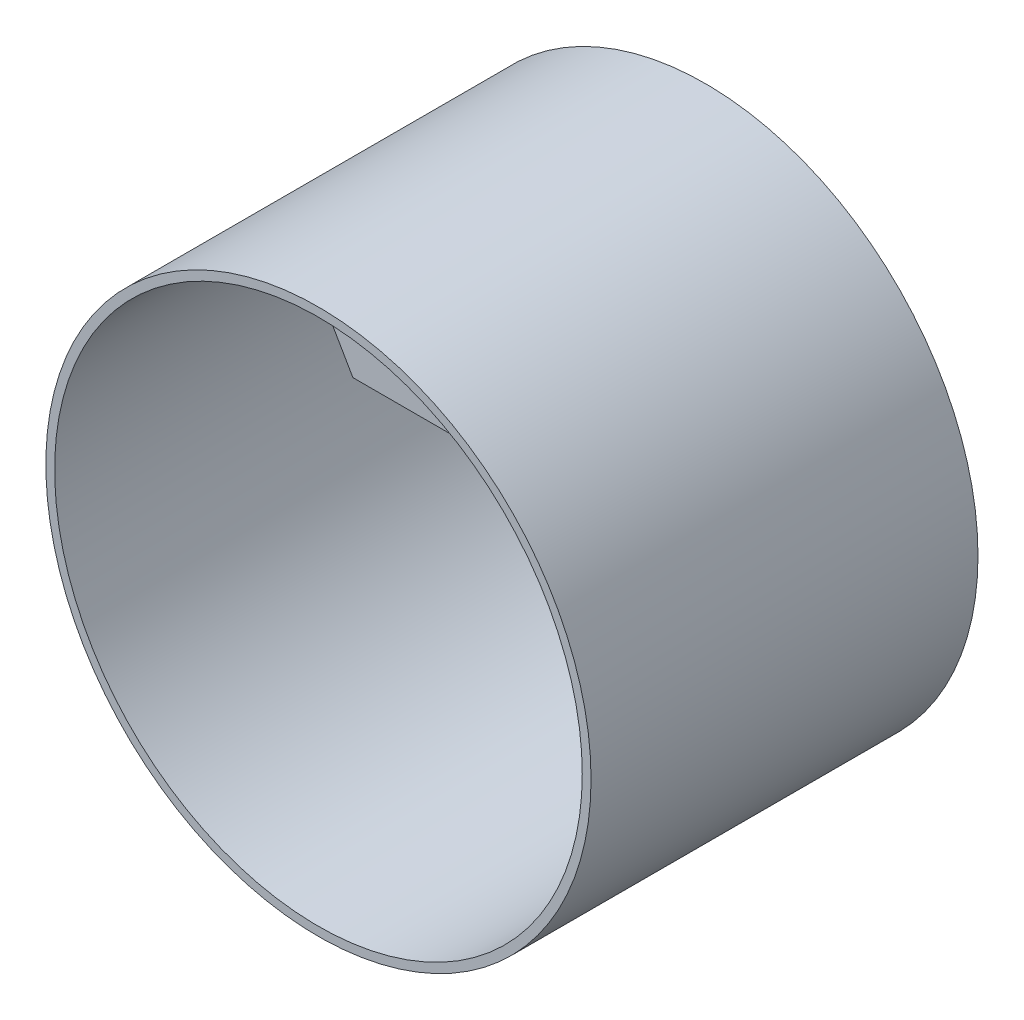
ISO-10303-21;
HEADER;
FILE_DESCRIPTION(('STEP AP214'),'2;1');
FILE_NAME('part.step','',(''),(''),'','','');
FILE_SCHEMA(('AUTOMOTIVE_DESIGN { 1 0 10303 214 1 1 1 1 }'));
ENDSEC;
DATA;
#1=APPLICATION_CONTEXT('core data for automotive mechanical design processes');
#2=APPLICATION_PROTOCOL_DEFINITION('international standard','automotive_design',2000,#1);
#3=PRODUCT_CONTEXT('',#1,'mechanical');
#4=PRODUCT('Part','Part','',(#3));
#5=PRODUCT_RELATED_PRODUCT_CATEGORY('part','',(#4));
#6=PRODUCT_DEFINITION_FORMATION('','',#4);
#7=PRODUCT_DEFINITION_CONTEXT('part definition',#1,'design');
#8=PRODUCT_DEFINITION('design','',#6,#7);
#9=PRODUCT_DEFINITION_SHAPE('','',#8);
#10=(LENGTH_UNIT() NAMED_UNIT(*) SI_UNIT(.MILLI.,.METRE.));
#11=(NAMED_UNIT(*) PLANE_ANGLE_UNIT() SI_UNIT($,.RADIAN.));
#12=(NAMED_UNIT(*) SI_UNIT($,.STERADIAN.) SOLID_ANGLE_UNIT());
#13=UNCERTAINTY_MEASURE_WITH_UNIT(LENGTH_MEASURE(1.E-05),#10,'distance_accuracy_value','');
#14=(GEOMETRIC_REPRESENTATION_CONTEXT(3) GLOBAL_UNCERTAINTY_ASSIGNED_CONTEXT((#13)) GLOBAL_UNIT_ASSIGNED_CONTEXT((#10,
#11,#12)) REPRESENTATION_CONTEXT('',''));
#15=CARTESIAN_POINT('',(0.,0.,0.));
#16=DIRECTION('',(0.,0.,1.));
#17=DIRECTION('',(1.,0.,0.));
#18=AXIS2_PLACEMENT_3D('',#15,#16,#17);
#19=CARTESIAN_POINT('',(0.,0.,110.));
#20=DIRECTION('',(0.,0.,1.));
#21=DIRECTION('',(1.,0.,0.));
#22=AXIS2_PLACEMENT_3D('',#19,#20,#21);
#23=PLANE('',#22);
#24=CARTESIAN_POINT('',(0.,0.,110.));
#25=DIRECTION('',(0.,0.,1.));
#26=DIRECTION('',(1.,0.,0.));
#27=AXIS2_PLACEMENT_3D('',#24,#25,#26);
#28=CIRCLE('',#27,155.);
#29=CARTESIAN_POINT('',(155.,0.,110.));
#30=VERTEX_POINT('',#29);
#31=EDGE_CURVE('E11',#30,#30,#28,.T.);
#32=ORIENTED_EDGE('',*,*,#31,.T.);
#33=EDGE_LOOP('',(#32));
#34=FACE_BOUND('',#33,.T.);
#35=CARTESIAN_POINT('',(0.,0.,110.));
#36=DIRECTION('',(0.,0.,1.));
#37=DIRECTION('',(1.,0.,0.));
#38=AXIS2_PLACEMENT_3D('',#35,#36,#37);
#39=CIRCLE('',#38,150.);
#40=CARTESIAN_POINT('',(150.,0.,110.));
#41=VERTEX_POINT('',#40);
#42=EDGE_CURVE('E115',#41,#41,#39,.T.);
#43=ORIENTED_EDGE('',*,*,#42,.F.);
#44=EDGE_LOOP('',(#43));
#45=FACE_BOUND('',#44,.T.);
#46=ADVANCED_FACE('F36',(#34,#45),#23,.T.);
#47=CARTESIAN_POINT('',(0.,0.,-110.));
#48=DIRECTION('',(0.,0.,1.));
#49=DIRECTION('',(1.,0.,0.));
#50=AXIS2_PLACEMENT_3D('',#47,#48,#49);
#51=PLANE('',#50);
#52=CARTESIAN_POINT('',(0.,0.,-110.));
#53=DIRECTION('',(0.,0.,1.));
#54=DIRECTION('',(1.,0.,0.));
#55=AXIS2_PLACEMENT_3D('',#52,#53,#54);
#56=CIRCLE('',#55,155.);
#57=CARTESIAN_POINT('',(155.,0.,-110.));
#58=VERTEX_POINT('',#57);
#59=EDGE_CURVE('E40',#58,#58,#56,.T.);
#60=ORIENTED_EDGE('',*,*,#59,.F.);
#61=EDGE_LOOP('',(#60));
#62=FACE_BOUND('',#61,.T.);
#63=CARTESIAN_POINT('',(0.,0.,-110.));
#64=DIRECTION('',(0.,0.,1.));
#65=DIRECTION('',(1.,0.,0.));
#66=AXIS2_PLACEMENT_3D('',#63,#64,#65);
#67=CIRCLE('',#66,150.);
#68=CARTESIAN_POINT('',(150.,0.,-110.));
#69=VERTEX_POINT('',#68);
#70=EDGE_CURVE('E114',#69,#69,#67,.T.);
#71=ORIENTED_EDGE('',*,*,#70,.T.);
#72=EDGE_LOOP('',(#71));
#73=FACE_BOUND('',#72,.T.);
#74=ADVANCED_FACE('F121',(#62,#73),#51,.F.);
#75=CARTESIAN_POINT('',(0.,0.,110.));
#76=DIRECTION('',(0.,0.,-1.));
#77=DIRECTION('',(-1.,0.,0.));
#78=AXIS2_PLACEMENT_3D('',#75,#76,#77);
#79=CYLINDRICAL_SURFACE('',#78,155.);
#80=ORIENTED_EDGE('',*,*,#31,.F.);
#81=EDGE_LOOP('',(#80));
#82=FACE_BOUND('',#81,.T.);
#83=ORIENTED_EDGE('',*,*,#59,.T.);
#84=EDGE_LOOP('',(#83));
#85=FACE_BOUND('',#84,.T.);
#86=ADVANCED_FACE('F38',(#82,#85),#79,.T.);
#87=CARTESIAN_POINT('',(0.,0.,110.));
#88=DIRECTION('',(0.,0.,-1.));
#89=DIRECTION('',(-1.,0.,0.));
#90=AXIS2_PLACEMENT_3D('',#87,#88,#89);
#91=CYLINDRICAL_SURFACE('',#90,150.);
#92=CARTESIAN_POINT('',(0.,0.,50.));
#93=DIRECTION('',(0.,0.,1.));
#94=DIRECTION('',(1.,0.,0.));
#95=AXIS2_PLACEMENT_3D('',#92,#93,#94);
#96=CIRCLE('',#95,150.);
#97=CARTESIAN_POINT('',(75.0000000000002,129.903810567666,50.));
#98=VERTEX_POINT('',#97);
#99=CARTESIAN_POINT('',(-75.0000000000002,129.903810567666,50.));
#100=VERTEX_POINT('',#99);
#101=EDGE_CURVE('E87',#98,#100,#96,.T.);
#102=ORIENTED_EDGE('',*,*,#101,.F.);
#103=DIRECTION('',(0.,0.,-1.));
#104=VECTOR('',#103,1.);
#105=CARTESIAN_POINT('',(75.0000000000002,129.903810567666,50.));
#106=LINE('',#105,#104);
#107=CARTESIAN_POINT('',(75.0000000000002,129.903810567666,-50.));
#108=VERTEX_POINT('',#107);
#109=EDGE_CURVE('E99',#98,#108,#106,.T.);
#110=ORIENTED_EDGE('',*,*,#109,.T.);
#111=CARTESIAN_POINT('',(0.,0.,-50.));
#112=DIRECTION('',(0.,0.,1.));
#113=DIRECTION('',(1.,0.,0.));
#114=AXIS2_PLACEMENT_3D('',#111,#112,#113);
#115=CIRCLE('',#114,150.);
#116=CARTESIAN_POINT('',(-75.0000000000002,129.903810567666,-50.));
#117=VERTEX_POINT('',#116);
#118=EDGE_CURVE('E103',#108,#117,#115,.T.);
#119=ORIENTED_EDGE('',*,*,#118,.T.);
#120=DIRECTION('',(0.,0.,-1.));
#121=VECTOR('',#120,1.);
#122=CARTESIAN_POINT('',(-75.0000000000002,129.903810567666,50.));
#123=LINE('',#122,#121);
#124=EDGE_CURVE('E51',#100,#117,#123,.T.);
#125=ORIENTED_EDGE('',*,*,#124,.F.);
#126=EDGE_LOOP('',(#102,#110,#119,#125));
#127=FACE_BOUND('',#126,.T.);
#128=ORIENTED_EDGE('',*,*,#42,.T.);
#129=EDGE_LOOP('',(#128));
#130=FACE_BOUND('',#129,.T.);
#131=ORIENTED_EDGE('',*,*,#70,.F.);
#132=EDGE_LOOP('',(#131));
#133=FACE_BOUND('',#132,.T.);
#134=ADVANCED_FACE('F123',(#127,#130,#133),#91,.F.);
#135=CARTESIAN_POINT('',(-40.4145188432739,70.,50.));
#136=DIRECTION('',(0.866025403784438,0.500000000000001,0.));
#137=DIRECTION('',(-0.500000000000001,0.866025403784438,0.));
#138=AXIS2_PLACEMENT_3D('',#135,#136,#137);
#139=PLANE('',#138);
#140=DIRECTION('',(0.500000000000001,-0.866025403784438,0.));
#141=VECTOR('',#140,1.);
#142=CARTESIAN_POINT('',(-40.4145188432739,70.,-50.));
#143=LINE('',#142,#141);
#144=CARTESIAN_POINT('',(-40.4145188432739,70.,-50.));
#145=VERTEX_POINT('',#144);
#146=EDGE_CURVE('E92',#117,#145,#143,.T.);
#147=ORIENTED_EDGE('',*,*,#146,.T.);
#148=DIRECTION('',(0.,0.,-1.));
#149=VECTOR('',#148,1.);
#150=CARTESIAN_POINT('',(-40.4145188432739,70.,50.));
#151=LINE('',#150,#149);
#152=CARTESIAN_POINT('',(-40.4145188432739,70.,50.));
#153=VERTEX_POINT('',#152);
#154=EDGE_CURVE('E90',#153,#145,#151,.T.);
#155=ORIENTED_EDGE('',*,*,#154,.F.);
#156=DIRECTION('',(0.500000000000001,-0.866025403784438,0.));
#157=VECTOR('',#156,1.);
#158=CARTESIAN_POINT('',(-40.4145188432739,70.,50.));
#159=LINE('',#158,#157);
#160=EDGE_CURVE('E81',#100,#153,#159,.T.);
#161=ORIENTED_EDGE('',*,*,#160,.F.);
#162=ORIENTED_EDGE('',*,*,#124,.T.);
#163=EDGE_LOOP('',(#147,#155,#161,#162));
#164=FACE_BOUND('',#163,.T.);
#165=ADVANCED_FACE('F91',(#164),#139,.F.);
#166=CARTESIAN_POINT('',(-40.4145188432739,70.,50.));
#167=DIRECTION('',(0.,1.,0.));
#168=DIRECTION('',(0.,0.,1.));
#169=AXIS2_PLACEMENT_3D('',#166,#167,#168);
#170=PLANE('',#169);
#171=DIRECTION('',(1.,0.,0.));
#172=VECTOR('',#171,1.);
#173=CARTESIAN_POINT('',(-40.4145188432739,70.,-50.));
#174=LINE('',#173,#172);
#175=CARTESIAN_POINT('',(40.4145188432739,70.,-50.));
#176=VERTEX_POINT('',#175);
#177=EDGE_CURVE('E107',#145,#176,#174,.T.);
#178=ORIENTED_EDGE('',*,*,#177,.T.);
#179=DIRECTION('',(0.,0.,-1.));
#180=VECTOR('',#179,1.);
#181=CARTESIAN_POINT('',(40.4145188432739,70.,50.));
#182=LINE('',#181,#180);
#183=CARTESIAN_POINT('',(40.4145188432739,70.,50.));
#184=VERTEX_POINT('',#183);
#185=EDGE_CURVE('E95',#184,#176,#182,.T.);
#186=ORIENTED_EDGE('',*,*,#185,.F.);
#187=DIRECTION('',(1.,0.,0.));
#188=VECTOR('',#187,1.);
#189=CARTESIAN_POINT('',(-40.4145188432739,70.,50.));
#190=LINE('',#189,#188);
#191=EDGE_CURVE('E84',#153,#184,#190,.T.);
#192=ORIENTED_EDGE('',*,*,#191,.F.);
#193=ORIENTED_EDGE('',*,*,#154,.T.);
#194=EDGE_LOOP('',(#178,#186,#192,#193));
#195=FACE_BOUND('',#194,.T.);
#196=ADVANCED_FACE('F97',(#195),#170,.F.);
#197=CARTESIAN_POINT('',(40.4145188432739,70.,50.));
#198=DIRECTION('',(-0.866025403784438,0.500000000000001,0.));
#199=DIRECTION('',(-0.500000000000001,-0.866025403784438,0.));
#200=AXIS2_PLACEMENT_3D('',#197,#198,#199);
#201=PLANE('',#200);
#202=DIRECTION('',(0.500000000000001,0.866025403784438,0.));
#203=VECTOR('',#202,1.);
#204=CARTESIAN_POINT('',(40.4145188432739,70.,-50.));
#205=LINE('',#204,#203);
#206=EDGE_CURVE('E76',#176,#108,#205,.T.);
#207=ORIENTED_EDGE('',*,*,#206,.T.);
#208=ORIENTED_EDGE('',*,*,#109,.F.);
#209=DIRECTION('',(0.500000000000001,0.866025403784438,0.));
#210=VECTOR('',#209,1.);
#211=CARTESIAN_POINT('',(40.4145188432739,70.,50.));
#212=LINE('',#211,#210);
#213=EDGE_CURVE('E60',#184,#98,#212,.T.);
#214=ORIENTED_EDGE('',*,*,#213,.F.);
#215=ORIENTED_EDGE('',*,*,#185,.T.);
#216=EDGE_LOOP('',(#207,#208,#214,#215));
#217=FACE_BOUND('',#216,.T.);
#218=ADVANCED_FACE('F172',(#217),#201,.F.);
#219=CARTESIAN_POINT('',(0.,0.,50.));
#220=DIRECTION('',(0.,0.,1.));
#221=DIRECTION('',(1.,0.,0.));
#222=AXIS2_PLACEMENT_3D('',#219,#220,#221);
#223=PLANE('',#222);
#224=ORIENTED_EDGE('',*,*,#101,.T.);
#225=ORIENTED_EDGE('',*,*,#160,.T.);
#226=ORIENTED_EDGE('',*,*,#191,.T.);
#227=ORIENTED_EDGE('',*,*,#213,.T.);
#228=EDGE_LOOP('',(#224,#225,#226,#227));
#229=FACE_BOUND('',#228,.T.);
#230=ADVANCED_FACE('F82',(#229),#223,.T.);
#231=CARTESIAN_POINT('',(0.,0.,-50.));
#232=DIRECTION('',(0.,0.,1.));
#233=DIRECTION('',(1.,0.,0.));
#234=AXIS2_PLACEMENT_3D('',#231,#232,#233);
#235=PLANE('',#234);
#236=ORIENTED_EDGE('',*,*,#118,.F.);
#237=ORIENTED_EDGE('',*,*,#206,.F.);
#238=ORIENTED_EDGE('',*,*,#177,.F.);
#239=ORIENTED_EDGE('',*,*,#146,.F.);
#240=EDGE_LOOP('',(#236,#237,#238,#239));
#241=FACE_BOUND('',#240,.T.);
#242=ADVANCED_FACE('F189',(#241),#235,.F.);
#243=CLOSED_SHELL('',(#46,#74,#86,#134,#165,#196,#218,#230,#242));
#244=MANIFOLD_SOLID_BREP('B2',#243);
#245=ADVANCED_BREP_SHAPE_REPRESENTATION('',(#18,#244),#14);
#246=SHAPE_DEFINITION_REPRESENTATION(#9,#245);
ENDSEC;
END-ISO-10303-21;
